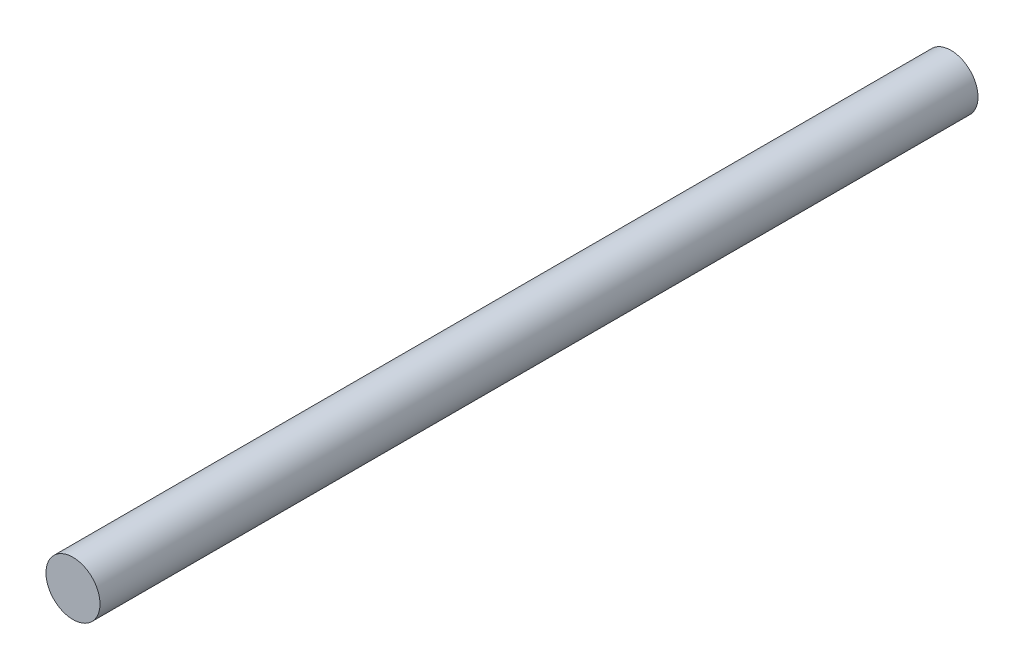
ISO-10303-21;
HEADER;
FILE_DESCRIPTION(('STEP AP214'),'2;1');
FILE_NAME('part.step','',(''),(''),'','','');
FILE_SCHEMA(('AUTOMOTIVE_DESIGN { 1 0 10303 214 1 1 1 1 }'));
ENDSEC;
DATA;
#1=APPLICATION_CONTEXT('core data for automotive mechanical design processes');
#2=APPLICATION_PROTOCOL_DEFINITION('international standard','automotive_design',2000,#1);
#3=PRODUCT_CONTEXT('',#1,'mechanical');
#4=PRODUCT('Part','Part','',(#3));
#5=PRODUCT_RELATED_PRODUCT_CATEGORY('part','',(#4));
#6=PRODUCT_DEFINITION_FORMATION('','',#4);
#7=PRODUCT_DEFINITION_CONTEXT('part definition',#1,'design');
#8=PRODUCT_DEFINITION('design','',#6,#7);
#9=PRODUCT_DEFINITION_SHAPE('','',#8);
#10=(LENGTH_UNIT() NAMED_UNIT(*) SI_UNIT(.MILLI.,.METRE.));
#11=(NAMED_UNIT(*) PLANE_ANGLE_UNIT() SI_UNIT($,.RADIAN.));
#12=(NAMED_UNIT(*) SI_UNIT($,.STERADIAN.) SOLID_ANGLE_UNIT());
#13=UNCERTAINTY_MEASURE_WITH_UNIT(LENGTH_MEASURE(1.E-05),#10,'distance_accuracy_value','');
#14=(GEOMETRIC_REPRESENTATION_CONTEXT(3) GLOBAL_UNCERTAINTY_ASSIGNED_CONTEXT((#13)) GLOBAL_UNIT_ASSIGNED_CONTEXT((#10,
#11,#12)) REPRESENTATION_CONTEXT('',''));
#15=CARTESIAN_POINT('',(0.,0.,0.));
#16=DIRECTION('',(0.,0.,1.));
#17=DIRECTION('',(1.,0.,0.));
#18=AXIS2_PLACEMENT_3D('',#15,#16,#17);
#19=CARTESIAN_POINT('',(0.,0.,130.));
#20=DIRECTION('',(0.,0.,-1.));
#21=DIRECTION('',(-1.,0.,0.));
#22=AXIS2_PLACEMENT_3D('',#19,#20,#21);
#23=CYLINDRICAL_SURFACE('',#22,4.);
#24=CARTESIAN_POINT('',(0.,0.,130.));
#25=DIRECTION('',(0.,0.,1.));
#26=DIRECTION('',(1.,0.,0.));
#27=AXIS2_PLACEMENT_3D('',#24,#25,#26);
#28=CIRCLE('',#27,4.);
#29=CARTESIAN_POINT('',(4.,0.,130.));
#30=VERTEX_POINT('',#29);
#31=EDGE_CURVE('E10',#30,#30,#28,.T.);
#32=ORIENTED_EDGE('',*,*,#31,.F.);
#33=EDGE_LOOP('',(#32));
#34=FACE_BOUND('',#33,.T.);
#35=CARTESIAN_POINT('',(0.,0.,0.));
#36=DIRECTION('',(0.,0.,1.));
#37=DIRECTION('',(1.,0.,0.));
#38=AXIS2_PLACEMENT_3D('',#35,#36,#37);
#39=CIRCLE('',#38,4.);
#40=CARTESIAN_POINT('',(4.,0.,0.));
#41=VERTEX_POINT('',#40);
#42=EDGE_CURVE('E33',#41,#41,#39,.T.);
#43=ORIENTED_EDGE('',*,*,#42,.T.);
#44=EDGE_LOOP('',(#43));
#45=FACE_BOUND('',#44,.T.);
#46=ADVANCED_FACE('F30',(#34,#45),#23,.T.);
#47=CARTESIAN_POINT('',(0.,0.,130.));
#48=DIRECTION('',(0.,0.,1.));
#49=DIRECTION('',(1.,0.,0.));
#50=AXIS2_PLACEMENT_3D('',#47,#48,#49);
#51=PLANE('',#50);
#52=ORIENTED_EDGE('',*,*,#31,.T.);
#53=EDGE_LOOP('',(#52));
#54=FACE_BOUND('',#53,.T.);
#55=ADVANCED_FACE('F45',(#54),#51,.T.);
#56=CARTESIAN_POINT('',(0.,0.,0.));
#57=DIRECTION('',(0.,0.,1.));
#58=DIRECTION('',(1.,0.,0.));
#59=AXIS2_PLACEMENT_3D('',#56,#57,#58);
#60=PLANE('',#59);
#61=ORIENTED_EDGE('',*,*,#42,.F.);
#62=EDGE_LOOP('',(#61));
#63=FACE_BOUND('',#62,.T.);
#64=ADVANCED_FACE('F43',(#63),#60,.F.);
#65=CLOSED_SHELL('',(#46,#55,#64));
#66=MANIFOLD_SOLID_BREP('B2',#65);
#67=ADVANCED_BREP_SHAPE_REPRESENTATION('',(#18,#66),#14);
#68=SHAPE_DEFINITION_REPRESENTATION(#9,#67);
ENDSEC;
END-ISO-10303-21;
